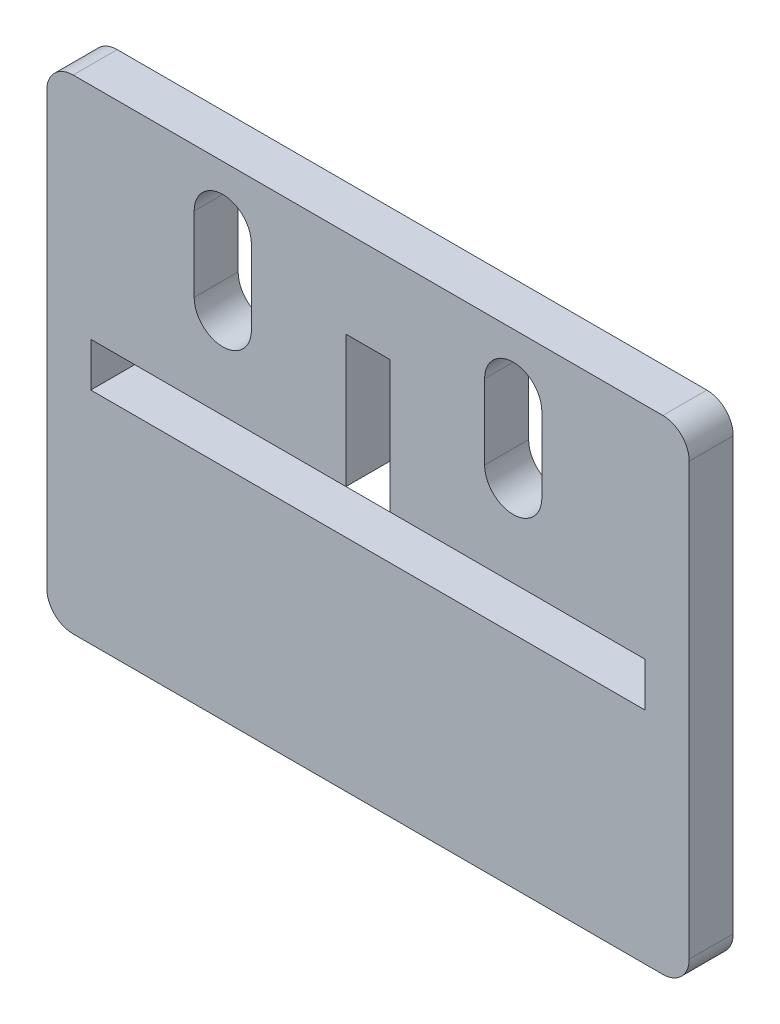
ISO-10303-21;
HEADER;
FILE_DESCRIPTION(('STEP AP214'),'2;1');
FILE_NAME('part.step','',(''),(''),'','','');
FILE_SCHEMA(('AUTOMOTIVE_DESIGN { 1 0 10303 214 1 1 1 1 }'));
ENDSEC;
DATA;
#1=APPLICATION_CONTEXT('core data for automotive mechanical design processes');
#2=APPLICATION_PROTOCOL_DEFINITION('international standard','automotive_design',2000,#1);
#3=PRODUCT_CONTEXT('',#1,'mechanical');
#4=PRODUCT('Part','Part','',(#3));
#5=PRODUCT_RELATED_PRODUCT_CATEGORY('part','',(#4));
#6=PRODUCT_DEFINITION_FORMATION('','',#4);
#7=PRODUCT_DEFINITION_CONTEXT('part definition',#1,'design');
#8=PRODUCT_DEFINITION('design','',#6,#7);
#9=PRODUCT_DEFINITION_SHAPE('','',#8);
#10=(LENGTH_UNIT() NAMED_UNIT(*) SI_UNIT(.MILLI.,.METRE.));
#11=(NAMED_UNIT(*) PLANE_ANGLE_UNIT() SI_UNIT($,.RADIAN.));
#12=(NAMED_UNIT(*) SI_UNIT($,.STERADIAN.) SOLID_ANGLE_UNIT());
#13=UNCERTAINTY_MEASURE_WITH_UNIT(LENGTH_MEASURE(1.E-05),#10,'distance_accuracy_value','');
#14=(GEOMETRIC_REPRESENTATION_CONTEXT(3) GLOBAL_UNCERTAINTY_ASSIGNED_CONTEXT((#13)) GLOBAL_UNIT_ASSIGNED_CONTEXT((#10,
#11,#12)) REPRESENTATION_CONTEXT('',''));
#15=CARTESIAN_POINT('',(0.,0.,0.));
#16=DIRECTION('',(0.,0.,1.));
#17=DIRECTION('',(1.,0.,0.));
#18=AXIS2_PLACEMENT_3D('',#15,#16,#17);
#19=CARTESIAN_POINT('',(33.5,24.5,5.));
#20=DIRECTION('',(0.,0.,1.));
#21=DIRECTION('',(1.,0.,0.));
#22=AXIS2_PLACEMENT_3D('',#19,#20,#21);
#23=PLANE('',#22);
#24=CARTESIAN_POINT('',(33.5,24.5,5.));
#25=DIRECTION('',(0.,0.,1.));
#26=DIRECTION('',(1.,0.,0.));
#27=AXIS2_PLACEMENT_3D('',#24,#25,#26);
#28=CIRCLE('',#27,3.);
#29=CARTESIAN_POINT('',(36.5,24.5,5.));
#30=VERTEX_POINT('',#29);
#31=CARTESIAN_POINT('',(33.5,27.5,5.));
#32=VERTEX_POINT('',#31);
#33=EDGE_CURVE('E322',#30,#32,#28,.T.);
#34=ORIENTED_EDGE('',*,*,#33,.T.);
#35=DIRECTION('',(-1.,0.,0.));
#36=VECTOR('',#35,1.);
#37=CARTESIAN_POINT('',(33.5,27.5,5.));
#38=LINE('',#37,#36);
#39=CARTESIAN_POINT('',(-33.5,27.5,5.));
#40=VERTEX_POINT('',#39);
#41=EDGE_CURVE('E325',#32,#40,#38,.T.);
#42=ORIENTED_EDGE('',*,*,#41,.T.);
#43=CARTESIAN_POINT('',(-33.5,24.5,5.));
#44=DIRECTION('',(0.,0.,1.));
#45=DIRECTION('',(1.,0.,0.));
#46=AXIS2_PLACEMENT_3D('',#43,#44,#45);
#47=CIRCLE('',#46,3.);
#48=CARTESIAN_POINT('',(-36.5,24.5,5.));
#49=VERTEX_POINT('',#48);
#50=EDGE_CURVE('E328',#40,#49,#47,.T.);
#51=ORIENTED_EDGE('',*,*,#50,.T.);
#52=DIRECTION('',(0.,-1.,0.));
#53=VECTOR('',#52,1.);
#54=CARTESIAN_POINT('',(-36.5,-24.5,5.));
#55=LINE('',#54,#53);
#56=CARTESIAN_POINT('',(-36.5,-24.5,5.));
#57=VERTEX_POINT('',#56);
#58=EDGE_CURVE('E330',#49,#57,#55,.T.);
#59=ORIENTED_EDGE('',*,*,#58,.T.);
#60=CARTESIAN_POINT('',(-33.5,-24.5,5.));
#61=DIRECTION('',(0.,0.,1.));
#62=DIRECTION('',(-1.,0.,0.));
#63=AXIS2_PLACEMENT_3D('',#60,#61,#62);
#64=CIRCLE('',#63,3.);
#65=CARTESIAN_POINT('',(-33.5,-27.5,5.));
#66=VERTEX_POINT('',#65);
#67=EDGE_CURVE('E332',#57,#66,#64,.T.);
#68=ORIENTED_EDGE('',*,*,#67,.T.);
#69=DIRECTION('',(1.,0.,0.));
#70=VECTOR('',#69,1.);
#71=CARTESIAN_POINT('',(33.5,-27.5,5.));
#72=LINE('',#71,#70);
#73=CARTESIAN_POINT('',(33.5,-27.5,5.));
#74=VERTEX_POINT('',#73);
#75=EDGE_CURVE('E334',#66,#74,#72,.T.);
#76=ORIENTED_EDGE('',*,*,#75,.T.);
#77=CARTESIAN_POINT('',(33.5,-24.5,5.));
#78=DIRECTION('',(0.,0.,1.));
#79=DIRECTION('',(1.,0.,0.));
#80=AXIS2_PLACEMENT_3D('',#77,#78,#79);
#81=CIRCLE('',#80,3.);
#82=CARTESIAN_POINT('',(36.5,-24.5,5.));
#83=VERTEX_POINT('',#82);
#84=EDGE_CURVE('E336',#74,#83,#81,.T.);
#85=ORIENTED_EDGE('',*,*,#84,.T.);
#86=DIRECTION('',(0.,1.,0.));
#87=VECTOR('',#86,1.);
#88=CARTESIAN_POINT('',(36.5,-24.5,5.));
#89=LINE('',#88,#87);
#90=EDGE_CURVE('E338',#83,#30,#89,.T.);
#91=ORIENTED_EDGE('',*,*,#90,.T.);
#92=EDGE_LOOP('',(#34,#42,#51,#59,#68,#76,#85,#91));
#93=FACE_BOUND('',#92,.T.);
#94=DIRECTION('',(-1.,0.,0.));
#95=VECTOR('',#94,1.);
#96=CARTESIAN_POINT('',(2.5,2.5,5.));
#97=LINE('',#96,#95);
#98=CARTESIAN_POINT('',(31.5,2.5,5.));
#99=VERTEX_POINT('',#98);
#100=CARTESIAN_POINT('',(2.5,2.5,5.));
#101=VERTEX_POINT('',#100);
#102=EDGE_CURVE('E265',#99,#101,#97,.T.);
#103=ORIENTED_EDGE('',*,*,#102,.F.);
#104=DIRECTION('',(0.,1.,0.));
#105=VECTOR('',#104,1.);
#106=CARTESIAN_POINT('',(31.5,-2.5,5.));
#107=LINE('',#106,#105);
#108=CARTESIAN_POINT('',(31.5,-2.5,5.));
#109=VERTEX_POINT('',#108);
#110=EDGE_CURVE('E263',#109,#99,#107,.T.);
#111=ORIENTED_EDGE('',*,*,#110,.F.);
#112=DIRECTION('',(1.,0.,0.));
#113=VECTOR('',#112,1.);
#114=CARTESIAN_POINT('',(-31.5,-2.5,5.));
#115=LINE('',#114,#113);
#116=CARTESIAN_POINT('',(-31.5,-2.5,5.));
#117=VERTEX_POINT('',#116);
#118=EDGE_CURVE('E279',#117,#109,#115,.T.);
#119=ORIENTED_EDGE('',*,*,#118,.F.);
#120=DIRECTION('',(0.,-1.,0.));
#121=VECTOR('',#120,1.);
#122=CARTESIAN_POINT('',(-31.5,2.49999999999999,5.));
#123=LINE('',#122,#121);
#124=CARTESIAN_POINT('',(-31.5,2.49999999999999,5.));
#125=VERTEX_POINT('',#124);
#126=EDGE_CURVE('E276',#125,#117,#123,.T.);
#127=ORIENTED_EDGE('',*,*,#126,.F.);
#128=DIRECTION('',(-1.,0.,0.));
#129=VECTOR('',#128,1.);
#130=CARTESIAN_POINT('',(-31.5,2.49999999999999,5.));
#131=LINE('',#130,#129);
#132=CARTESIAN_POINT('',(-2.5,2.5,5.));
#133=VERTEX_POINT('',#132);
#134=EDGE_CURVE('E274',#133,#125,#131,.T.);
#135=ORIENTED_EDGE('',*,*,#134,.F.);
#136=DIRECTION('',(0.,-1.,0.));
#137=VECTOR('',#136,1.);
#138=CARTESIAN_POINT('',(-2.5,17.5,5.));
#139=LINE('',#138,#137);
#140=CARTESIAN_POINT('',(-2.5,17.5,5.));
#141=VERTEX_POINT('',#140);
#142=EDGE_CURVE('E272',#141,#133,#139,.T.);
#143=ORIENTED_EDGE('',*,*,#142,.F.);
#144=DIRECTION('',(-1.,0.,0.));
#145=VECTOR('',#144,1.);
#146=CARTESIAN_POINT('',(2.5,17.5,5.));
#147=LINE('',#146,#145);
#148=CARTESIAN_POINT('',(2.5,17.5,5.));
#149=VERTEX_POINT('',#148);
#150=EDGE_CURVE('E270',#149,#141,#147,.T.);
#151=ORIENTED_EDGE('',*,*,#150,.F.);
#152=DIRECTION('',(0.,1.,0.));
#153=VECTOR('',#152,1.);
#154=CARTESIAN_POINT('',(2.5,17.5,5.));
#155=LINE('',#154,#153);
#156=EDGE_CURVE('E268',#101,#149,#155,.T.);
#157=ORIENTED_EDGE('',*,*,#156,.F.);
#158=EDGE_LOOP('',(#103,#111,#119,#127,#135,#143,#151,#157));
#159=FACE_BOUND('',#158,.T.);
#160=DIRECTION('',(0.,-1.,0.));
#161=VECTOR('',#160,1.);
#162=CARTESIAN_POINT('',(13.25,21.0000000000003,5.));
#163=LINE('',#162,#161);
#164=CARTESIAN_POINT('',(13.25,21.0000000000003,5.));
#165=VERTEX_POINT('',#164);
#166=CARTESIAN_POINT('',(13.25,12.5000000000003,5.));
#167=VERTEX_POINT('',#166);
#168=EDGE_CURVE('E234',#165,#167,#163,.T.);
#169=ORIENTED_EDGE('',*,*,#168,.F.);
#170=CARTESIAN_POINT('',(16.5,21.0000000000003,5.));
#171=DIRECTION('',(0.,0.,1.));
#172=DIRECTION('',(1.,0.,0.));
#173=AXIS2_PLACEMENT_3D('',#170,#171,#172);
#174=CIRCLE('',#173,3.25);
#175=CARTESIAN_POINT('',(19.75,21.0000000000003,5.));
#176=VERTEX_POINT('',#175);
#177=EDGE_CURVE('E232',#176,#165,#174,.T.);
#178=ORIENTED_EDGE('',*,*,#177,.F.);
#179=DIRECTION('',(0.,1.,0.));
#180=VECTOR('',#179,1.);
#181=CARTESIAN_POINT('',(19.75,12.5000000000003,5.));
#182=LINE('',#181,#180);
#183=CARTESIAN_POINT('',(19.75,12.5000000000003,5.));
#184=VERTEX_POINT('',#183);
#185=EDGE_CURVE('E240',#184,#176,#182,.T.);
#186=ORIENTED_EDGE('',*,*,#185,.F.);
#187=CARTESIAN_POINT('',(16.5,12.5000000000003,5.));
#188=DIRECTION('',(0.,0.,1.));
#189=DIRECTION('',(1.,0.,0.));
#190=AXIS2_PLACEMENT_3D('',#187,#188,#189);
#191=CIRCLE('',#190,3.25);
#192=EDGE_CURVE('E237',#167,#184,#191,.T.);
#193=ORIENTED_EDGE('',*,*,#192,.F.);
#194=EDGE_LOOP('',(#169,#178,#186,#193));
#195=FACE_BOUND('',#194,.T.);
#196=DIRECTION('',(0.,-1.,0.));
#197=VECTOR('',#196,1.);
#198=CARTESIAN_POINT('',(-19.75,12.5000000000003,5.));
#199=LINE('',#198,#197);
#200=CARTESIAN_POINT('',(-19.75,21.0000000000003,5.));
#201=VERTEX_POINT('',#200);
#202=CARTESIAN_POINT('',(-19.75,12.5000000000003,5.));
#203=VERTEX_POINT('',#202);
#204=EDGE_CURVE('E204',#201,#203,#199,.T.);
#205=ORIENTED_EDGE('',*,*,#204,.F.);
#206=CARTESIAN_POINT('',(-16.5,21.0000000000003,5.));
#207=DIRECTION('',(0.,0.,1.));
#208=DIRECTION('',(-1.,0.,0.));
#209=AXIS2_PLACEMENT_3D('',#206,#207,#208);
#210=CIRCLE('',#209,3.25);
#211=CARTESIAN_POINT('',(-13.25,21.0000000000003,5.));
#212=VERTEX_POINT('',#211);
#213=EDGE_CURVE('E196',#212,#201,#210,.T.);
#214=ORIENTED_EDGE('',*,*,#213,.F.);
#215=DIRECTION('',(0.,1.,0.));
#216=VECTOR('',#215,1.);
#217=CARTESIAN_POINT('',(-13.25,21.0000000000003,5.));
#218=LINE('',#217,#216);
#219=CARTESIAN_POINT('',(-13.25,12.5000000000003,5.));
#220=VERTEX_POINT('',#219);
#221=EDGE_CURVE('E218',#220,#212,#218,.T.);
#222=ORIENTED_EDGE('',*,*,#221,.F.);
#223=CARTESIAN_POINT('',(-16.5,12.5000000000003,5.));
#224=DIRECTION('',(0.,0.,1.));
#225=DIRECTION('',(-1.,0.,0.));
#226=AXIS2_PLACEMENT_3D('',#223,#224,#225);
#227=CIRCLE('',#226,3.25);
#228=EDGE_CURVE('E216',#203,#220,#227,.T.);
#229=ORIENTED_EDGE('',*,*,#228,.F.);
#230=EDGE_LOOP('',(#205,#214,#222,#229));
#231=FACE_BOUND('',#230,.T.);
#232=ADVANCED_FACE('F35',(#93,#159,#195,#231),#23,.T.);
#233=CARTESIAN_POINT('',(33.5,24.5,0.));
#234=DIRECTION('',(0.,0.,1.));
#235=DIRECTION('',(1.,0.,0.));
#236=AXIS2_PLACEMENT_3D('',#233,#234,#235);
#237=PLANE('',#236);
#238=CARTESIAN_POINT('',(16.5,21.0000000000003,0.));
#239=DIRECTION('',(0.,0.,1.));
#240=DIRECTION('',(1.,0.,0.));
#241=AXIS2_PLACEMENT_3D('',#238,#239,#240);
#242=CIRCLE('',#241,3.25);
#243=CARTESIAN_POINT('',(19.75,21.0000000000003,0.));
#244=VERTEX_POINT('',#243);
#245=CARTESIAN_POINT('',(13.25,21.0000000000003,0.));
#246=VERTEX_POINT('',#245);
#247=EDGE_CURVE('E212',#244,#246,#242,.T.);
#248=ORIENTED_EDGE('',*,*,#247,.T.);
#249=DIRECTION('',(0.,-1.,0.));
#250=VECTOR('',#249,1.);
#251=CARTESIAN_POINT('',(13.25,21.0000000000003,0.));
#252=LINE('',#251,#250);
#253=CARTESIAN_POINT('',(13.25,12.5000000000003,0.));
#254=VERTEX_POINT('',#253);
#255=EDGE_CURVE('E245',#246,#254,#252,.T.);
#256=ORIENTED_EDGE('',*,*,#255,.T.);
#257=CARTESIAN_POINT('',(16.5,12.5000000000003,0.));
#258=DIRECTION('',(0.,0.,1.));
#259=DIRECTION('',(1.,0.,0.));
#260=AXIS2_PLACEMENT_3D('',#257,#258,#259);
#261=CIRCLE('',#260,3.25);
#262=CARTESIAN_POINT('',(19.75,12.5000000000003,0.));
#263=VERTEX_POINT('',#262);
#264=EDGE_CURVE('E248',#254,#263,#261,.T.);
#265=ORIENTED_EDGE('',*,*,#264,.T.);
#266=DIRECTION('',(0.,1.,0.));
#267=VECTOR('',#266,1.);
#268=CARTESIAN_POINT('',(19.75,12.5000000000003,0.));
#269=LINE('',#268,#267);
#270=EDGE_CURVE('E235',#263,#244,#269,.T.);
#271=ORIENTED_EDGE('',*,*,#270,.T.);
#272=EDGE_LOOP('',(#248,#256,#265,#271));
#273=FACE_BOUND('',#272,.T.);
#274=CARTESIAN_POINT('',(33.5,24.5,0.));
#275=DIRECTION('',(0.,0.,1.));
#276=DIRECTION('',(1.,0.,0.));
#277=AXIS2_PLACEMENT_3D('',#274,#275,#276);
#278=CIRCLE('',#277,3.);
#279=CARTESIAN_POINT('',(36.5,24.5,0.));
#280=VERTEX_POINT('',#279);
#281=CARTESIAN_POINT('',(33.5,27.5,0.));
#282=VERTEX_POINT('',#281);
#283=EDGE_CURVE('E321',#280,#282,#278,.T.);
#284=ORIENTED_EDGE('',*,*,#283,.F.);
#285=DIRECTION('',(0.,1.,0.));
#286=VECTOR('',#285,1.);
#287=CARTESIAN_POINT('',(36.5,-24.5,0.));
#288=LINE('',#287,#286);
#289=CARTESIAN_POINT('',(36.5,-24.5,0.));
#290=VERTEX_POINT('',#289);
#291=EDGE_CURVE('E326',#290,#280,#288,.T.);
#292=ORIENTED_EDGE('',*,*,#291,.F.);
#293=CARTESIAN_POINT('',(33.5,-24.5,0.));
#294=DIRECTION('',(0.,0.,1.));
#295=DIRECTION('',(1.,0.,0.));
#296=AXIS2_PLACEMENT_3D('',#293,#294,#295);
#297=CIRCLE('',#296,3.);
#298=CARTESIAN_POINT('',(33.5,-27.5,0.));
#299=VERTEX_POINT('',#298);
#300=EDGE_CURVE('E353',#299,#290,#297,.T.);
#301=ORIENTED_EDGE('',*,*,#300,.F.);
#302=DIRECTION('',(1.,0.,0.));
#303=VECTOR('',#302,1.);
#304=CARTESIAN_POINT('',(33.5,-27.5,0.));
#305=LINE('',#304,#303);
#306=CARTESIAN_POINT('',(-33.5,-27.5,0.));
#307=VERTEX_POINT('',#306);
#308=EDGE_CURVE('E351',#307,#299,#305,.T.);
#309=ORIENTED_EDGE('',*,*,#308,.F.);
#310=CARTESIAN_POINT('',(-33.5,-24.5,0.));
#311=DIRECTION('',(0.,0.,1.));
#312=DIRECTION('',(-1.,0.,0.));
#313=AXIS2_PLACEMENT_3D('',#310,#311,#312);
#314=CIRCLE('',#313,3.);
#315=CARTESIAN_POINT('',(-36.5,-24.5,0.));
#316=VERTEX_POINT('',#315);
#317=EDGE_CURVE('E349',#316,#307,#314,.T.);
#318=ORIENTED_EDGE('',*,*,#317,.F.);
#319=DIRECTION('',(0.,-1.,0.));
#320=VECTOR('',#319,1.);
#321=CARTESIAN_POINT('',(-36.5,-24.5,0.));
#322=LINE('',#321,#320);
#323=CARTESIAN_POINT('',(-36.5,24.5,0.));
#324=VERTEX_POINT('',#323);
#325=EDGE_CURVE('E347',#324,#316,#322,.T.);
#326=ORIENTED_EDGE('',*,*,#325,.F.);
#327=CARTESIAN_POINT('',(-33.5,24.5,0.));
#328=DIRECTION('',(0.,0.,1.));
#329=DIRECTION('',(1.,0.,0.));
#330=AXIS2_PLACEMENT_3D('',#327,#328,#329);
#331=CIRCLE('',#330,3.);
#332=CARTESIAN_POINT('',(-33.5,27.5,0.));
#333=VERTEX_POINT('',#332);
#334=EDGE_CURVE('E345',#333,#324,#331,.T.);
#335=ORIENTED_EDGE('',*,*,#334,.F.);
#336=DIRECTION('',(-1.,0.,0.));
#337=VECTOR('',#336,1.);
#338=CARTESIAN_POINT('',(33.5,27.5,0.));
#339=LINE('',#338,#337);
#340=EDGE_CURVE('E343',#282,#333,#339,.T.);
#341=ORIENTED_EDGE('',*,*,#340,.F.);
#342=EDGE_LOOP('',(#284,#292,#301,#309,#318,#326,#335,#341));
#343=FACE_BOUND('',#342,.T.);
#344=DIRECTION('',(0.,1.,0.));
#345=VECTOR('',#344,1.);
#346=CARTESIAN_POINT('',(31.5,-2.5,0.));
#347=LINE('',#346,#345);
#348=CARTESIAN_POINT('',(31.5,-2.5,0.));
#349=VERTEX_POINT('',#348);
#350=CARTESIAN_POINT('',(31.5,2.5,0.));
#351=VERTEX_POINT('',#350);
#352=EDGE_CURVE('E262',#349,#351,#347,.T.);
#353=ORIENTED_EDGE('',*,*,#352,.T.);
#354=DIRECTION('',(-1.,0.,0.));
#355=VECTOR('',#354,1.);
#356=CARTESIAN_POINT('',(2.5,2.5,0.));
#357=LINE('',#356,#355);
#358=CARTESIAN_POINT('',(2.5,2.5,0.));
#359=VERTEX_POINT('',#358);
#360=EDGE_CURVE('E284',#351,#359,#357,.T.);
#361=ORIENTED_EDGE('',*,*,#360,.T.);
#362=DIRECTION('',(0.,1.,0.));
#363=VECTOR('',#362,1.);
#364=CARTESIAN_POINT('',(2.5,17.5,0.));
#365=LINE('',#364,#363);
#366=CARTESIAN_POINT('',(2.5,17.5,0.));
#367=VERTEX_POINT('',#366);
#368=EDGE_CURVE('E287',#359,#367,#365,.T.);
#369=ORIENTED_EDGE('',*,*,#368,.T.);
#370=DIRECTION('',(-1.,0.,0.));
#371=VECTOR('',#370,1.);
#372=CARTESIAN_POINT('',(2.5,17.5,0.));
#373=LINE('',#372,#371);
#374=CARTESIAN_POINT('',(-2.5,17.5,0.));
#375=VERTEX_POINT('',#374);
#376=EDGE_CURVE('E290',#367,#375,#373,.T.);
#377=ORIENTED_EDGE('',*,*,#376,.T.);
#378=DIRECTION('',(0.,-1.,0.));
#379=VECTOR('',#378,1.);
#380=CARTESIAN_POINT('',(-2.5,17.5,0.));
#381=LINE('',#380,#379);
#382=CARTESIAN_POINT('',(-2.5,2.5,0.));
#383=VERTEX_POINT('',#382);
#384=EDGE_CURVE('E293',#375,#383,#381,.T.);
#385=ORIENTED_EDGE('',*,*,#384,.T.);
#386=DIRECTION('',(-1.,0.,0.));
#387=VECTOR('',#386,1.);
#388=CARTESIAN_POINT('',(-31.5,2.49999999999999,0.));
#389=LINE('',#388,#387);
#390=CARTESIAN_POINT('',(-31.5,2.49999999999999,0.));
#391=VERTEX_POINT('',#390);
#392=EDGE_CURVE('E296',#383,#391,#389,.T.);
#393=ORIENTED_EDGE('',*,*,#392,.T.);
#394=DIRECTION('',(0.,-1.,0.));
#395=VECTOR('',#394,1.);
#396=CARTESIAN_POINT('',(-31.5,2.49999999999999,0.));
#397=LINE('',#396,#395);
#398=CARTESIAN_POINT('',(-31.5,-2.5,0.));
#399=VERTEX_POINT('',#398);
#400=EDGE_CURVE('E299',#391,#399,#397,.T.);
#401=ORIENTED_EDGE('',*,*,#400,.T.);
#402=DIRECTION('',(1.,0.,0.));
#403=VECTOR('',#402,1.);
#404=CARTESIAN_POINT('',(-31.5,-2.5,0.));
#405=LINE('',#404,#403);
#406=EDGE_CURVE('E266',#399,#349,#405,.T.);
#407=ORIENTED_EDGE('',*,*,#406,.T.);
#408=EDGE_LOOP('',(#353,#361,#369,#377,#385,#393,#401,#407));
#409=FACE_BOUND('',#408,.T.);
#410=CARTESIAN_POINT('',(-16.5,21.0000000000003,0.));
#411=DIRECTION('',(0.,0.,1.));
#412=DIRECTION('',(-1.,0.,0.));
#413=AXIS2_PLACEMENT_3D('',#410,#411,#412);
#414=CIRCLE('',#413,3.25);
#415=CARTESIAN_POINT('',(-13.25,21.0000000000003,0.));
#416=VERTEX_POINT('',#415);
#417=CARTESIAN_POINT('',(-19.75,21.0000000000003,0.));
#418=VERTEX_POINT('',#417);
#419=EDGE_CURVE('E58',#416,#418,#414,.T.);
#420=ORIENTED_EDGE('',*,*,#419,.T.);
#421=DIRECTION('',(0.,-1.,0.));
#422=VECTOR('',#421,1.);
#423=CARTESIAN_POINT('',(-19.75,12.5000000000003,0.));
#424=LINE('',#423,#422);
#425=CARTESIAN_POINT('',(-19.75,12.5000000000003,0.));
#426=VERTEX_POINT('',#425);
#427=EDGE_CURVE('E211',#418,#426,#424,.T.);
#428=ORIENTED_EDGE('',*,*,#427,.T.);
#429=CARTESIAN_POINT('',(-16.5,12.5000000000003,0.));
#430=DIRECTION('',(0.,0.,1.));
#431=DIRECTION('',(-1.,0.,0.));
#432=AXIS2_PLACEMENT_3D('',#429,#430,#431);
#433=CIRCLE('',#432,3.25);
#434=CARTESIAN_POINT('',(-13.25,12.5000000000003,0.));
#435=VERTEX_POINT('',#434);
#436=EDGE_CURVE('E224',#426,#435,#433,.T.);
#437=ORIENTED_EDGE('',*,*,#436,.T.);
#438=DIRECTION('',(0.,1.,0.));
#439=VECTOR('',#438,1.);
#440=CARTESIAN_POINT('',(-13.25,21.0000000000003,0.));
#441=LINE('',#440,#439);
#442=EDGE_CURVE('E205',#435,#416,#441,.T.);
#443=ORIENTED_EDGE('',*,*,#442,.T.);
#444=EDGE_LOOP('',(#420,#428,#437,#443));
#445=FACE_BOUND('',#444,.T.);
#446=ADVANCED_FACE('F383',(#273,#343,#409,#445),#237,.F.);
#447=CARTESIAN_POINT('',(33.5,24.5,5.));
#448=DIRECTION('',(0.,0.,-1.));
#449=DIRECTION('',(-1.,0.,0.));
#450=AXIS2_PLACEMENT_3D('',#447,#448,#449);
#451=CYLINDRICAL_SURFACE('',#450,3.);
#452=ORIENTED_EDGE('',*,*,#283,.T.);
#453=DIRECTION('',(0.,0.,-1.));
#454=VECTOR('',#453,1.);
#455=CARTESIAN_POINT('',(33.5,27.5,5.));
#456=LINE('',#455,#454);
#457=EDGE_CURVE('E11',#32,#282,#456,.T.);
#458=ORIENTED_EDGE('',*,*,#457,.F.);
#459=ORIENTED_EDGE('',*,*,#33,.F.);
#460=DIRECTION('',(0.,0.,-1.));
#461=VECTOR('',#460,1.);
#462=CARTESIAN_POINT('',(36.5,24.5,5.));
#463=LINE('',#462,#461);
#464=EDGE_CURVE('E340',#30,#280,#463,.T.);
#465=ORIENTED_EDGE('',*,*,#464,.T.);
#466=EDGE_LOOP('',(#452,#458,#459,#465));
#467=FACE_BOUND('',#466,.T.);
#468=ADVANCED_FACE('F37',(#467),#451,.T.);
#469=CARTESIAN_POINT('',(33.5,27.5,5.));
#470=DIRECTION('',(0.,-1.,0.));
#471=DIRECTION('',(0.,0.,-1.));
#472=AXIS2_PLACEMENT_3D('',#469,#470,#471);
#473=PLANE('',#472);
#474=ORIENTED_EDGE('',*,*,#340,.T.);
#475=DIRECTION('',(0.,0.,-1.));
#476=VECTOR('',#475,1.);
#477=CARTESIAN_POINT('',(-33.5,27.5,5.));
#478=LINE('',#477,#476);
#479=EDGE_CURVE('E43',#40,#333,#478,.T.);
#480=ORIENTED_EDGE('',*,*,#479,.F.);
#481=ORIENTED_EDGE('',*,*,#41,.F.);
#482=ORIENTED_EDGE('',*,*,#457,.T.);
#483=EDGE_LOOP('',(#474,#480,#481,#482));
#484=FACE_BOUND('',#483,.T.);
#485=ADVANCED_FACE('F401',(#484),#473,.F.);
#486=CARTESIAN_POINT('',(-33.5,24.5,5.));
#487=DIRECTION('',(0.,0.,-1.));
#488=DIRECTION('',(-1.,0.,0.));
#489=AXIS2_PLACEMENT_3D('',#486,#487,#488);
#490=CYLINDRICAL_SURFACE('',#489,3.);
#491=ORIENTED_EDGE('',*,*,#334,.T.);
#492=DIRECTION('',(0.,0.,-1.));
#493=VECTOR('',#492,1.);
#494=CARTESIAN_POINT('',(-36.5,24.5,5.));
#495=LINE('',#494,#493);
#496=EDGE_CURVE('E370',#49,#324,#495,.T.);
#497=ORIENTED_EDGE('',*,*,#496,.F.);
#498=ORIENTED_EDGE('',*,*,#50,.F.);
#499=ORIENTED_EDGE('',*,*,#479,.T.);
#500=EDGE_LOOP('',(#491,#497,#498,#499));
#501=FACE_BOUND('',#500,.T.);
#502=ADVANCED_FACE('F377',(#501),#490,.T.);
#503=CARTESIAN_POINT('',(-36.5,-24.5,5.));
#504=DIRECTION('',(1.,0.,0.));
#505=DIRECTION('',(0.,0.,-1.));
#506=AXIS2_PLACEMENT_3D('',#503,#504,#505);
#507=PLANE('',#506);
#508=ORIENTED_EDGE('',*,*,#325,.T.);
#509=DIRECTION('',(0.,0.,-1.));
#510=VECTOR('',#509,1.);
#511=CARTESIAN_POINT('',(-36.5,-24.5,5.));
#512=LINE('',#511,#510);
#513=EDGE_CURVE('E367',#57,#316,#512,.T.);
#514=ORIENTED_EDGE('',*,*,#513,.F.);
#515=ORIENTED_EDGE('',*,*,#58,.F.);
#516=ORIENTED_EDGE('',*,*,#496,.T.);
#517=EDGE_LOOP('',(#508,#514,#515,#516));
#518=FACE_BOUND('',#517,.T.);
#519=ADVANCED_FACE('F389',(#518),#507,.F.);
#520=CARTESIAN_POINT('',(-33.5,-24.5,5.));
#521=DIRECTION('',(0.,0.,-1.));
#522=DIRECTION('',(-1.,0.,0.));
#523=AXIS2_PLACEMENT_3D('',#520,#521,#522);
#524=CYLINDRICAL_SURFACE('',#523,3.);
#525=ORIENTED_EDGE('',*,*,#317,.T.);
#526=DIRECTION('',(0.,0.,-1.));
#527=VECTOR('',#526,1.);
#528=CARTESIAN_POINT('',(-33.5,-27.5,5.));
#529=LINE('',#528,#527);
#530=EDGE_CURVE('E364',#66,#307,#529,.T.);
#531=ORIENTED_EDGE('',*,*,#530,.F.);
#532=ORIENTED_EDGE('',*,*,#67,.F.);
#533=ORIENTED_EDGE('',*,*,#513,.T.);
#534=EDGE_LOOP('',(#525,#531,#532,#533));
#535=FACE_BOUND('',#534,.T.);
#536=ADVANCED_FACE('F393',(#535),#524,.T.);
#537=CARTESIAN_POINT('',(33.5,-27.5,5.));
#538=DIRECTION('',(0.,1.,0.));
#539=DIRECTION('',(0.,0.,1.));
#540=AXIS2_PLACEMENT_3D('',#537,#538,#539);
#541=PLANE('',#540);
#542=ORIENTED_EDGE('',*,*,#308,.T.);
#543=DIRECTION('',(0.,0.,-1.));
#544=VECTOR('',#543,1.);
#545=CARTESIAN_POINT('',(33.5,-27.5,5.));
#546=LINE('',#545,#544);
#547=EDGE_CURVE('E361',#74,#299,#546,.T.);
#548=ORIENTED_EDGE('',*,*,#547,.F.);
#549=ORIENTED_EDGE('',*,*,#75,.F.);
#550=ORIENTED_EDGE('',*,*,#530,.T.);
#551=EDGE_LOOP('',(#542,#548,#549,#550));
#552=FACE_BOUND('',#551,.T.);
#553=ADVANCED_FACE('F414',(#552),#541,.F.);
#554=CARTESIAN_POINT('',(33.5,-24.5,5.));
#555=DIRECTION('',(0.,0.,-1.));
#556=DIRECTION('',(-1.,0.,0.));
#557=AXIS2_PLACEMENT_3D('',#554,#555,#556);
#558=CYLINDRICAL_SURFACE('',#557,3.);
#559=ORIENTED_EDGE('',*,*,#300,.T.);
#560=DIRECTION('',(0.,0.,-1.));
#561=VECTOR('',#560,1.);
#562=CARTESIAN_POINT('',(36.5,-24.5,5.));
#563=LINE('',#562,#561);
#564=EDGE_CURVE('E358',#83,#290,#563,.T.);
#565=ORIENTED_EDGE('',*,*,#564,.F.);
#566=ORIENTED_EDGE('',*,*,#84,.F.);
#567=ORIENTED_EDGE('',*,*,#547,.T.);
#568=EDGE_LOOP('',(#559,#565,#566,#567));
#569=FACE_BOUND('',#568,.T.);
#570=ADVANCED_FACE('F412',(#569),#558,.T.);
#571=CARTESIAN_POINT('',(36.5,-24.5,5.));
#572=DIRECTION('',(-1.,0.,0.));
#573=DIRECTION('',(0.,0.,1.));
#574=AXIS2_PLACEMENT_3D('',#571,#572,#573);
#575=PLANE('',#574);
#576=ORIENTED_EDGE('',*,*,#291,.T.);
#577=ORIENTED_EDGE('',*,*,#464,.F.);
#578=ORIENTED_EDGE('',*,*,#90,.F.);
#579=ORIENTED_EDGE('',*,*,#564,.T.);
#580=EDGE_LOOP('',(#576,#577,#578,#579));
#581=FACE_BOUND('',#580,.T.);
#582=ADVANCED_FACE('F407',(#581),#575,.F.);
#583=CARTESIAN_POINT('',(31.5,-2.5,5.));
#584=DIRECTION('',(-1.,0.,0.));
#585=DIRECTION('',(0.,0.,1.));
#586=AXIS2_PLACEMENT_3D('',#583,#584,#585);
#587=PLANE('',#586);
#588=ORIENTED_EDGE('',*,*,#352,.F.);
#589=DIRECTION('',(0.,0.,-1.));
#590=VECTOR('',#589,1.);
#591=CARTESIAN_POINT('',(31.5,-2.5,5.));
#592=LINE('',#591,#590);
#593=EDGE_CURVE('E281',#109,#349,#592,.T.);
#594=ORIENTED_EDGE('',*,*,#593,.F.);
#595=ORIENTED_EDGE('',*,*,#110,.T.);
#596=DIRECTION('',(0.,0.,-1.));
#597=VECTOR('',#596,1.);
#598=CARTESIAN_POINT('',(31.5,2.5,5.));
#599=LINE('',#598,#597);
#600=EDGE_CURVE('E318',#99,#351,#599,.T.);
#601=ORIENTED_EDGE('',*,*,#600,.T.);
#602=EDGE_LOOP('',(#588,#594,#595,#601));
#603=FACE_BOUND('',#602,.T.);
#604=ADVANCED_FACE('F431',(#603),#587,.T.);
#605=CARTESIAN_POINT('',(2.5,2.5,5.));
#606=DIRECTION('',(0.,-1.,0.));
#607=DIRECTION('',(0.,0.,-1.));
#608=AXIS2_PLACEMENT_3D('',#605,#606,#607);
#609=PLANE('',#608);
#610=ORIENTED_EDGE('',*,*,#360,.F.);
#611=ORIENTED_EDGE('',*,*,#600,.F.);
#612=ORIENTED_EDGE('',*,*,#102,.T.);
#613=DIRECTION('',(0.,0.,-1.));
#614=VECTOR('',#613,1.);
#615=CARTESIAN_POINT('',(2.5,2.5,5.));
#616=LINE('',#615,#614);
#617=EDGE_CURVE('E316',#101,#359,#616,.T.);
#618=ORIENTED_EDGE('',*,*,#617,.T.);
#619=EDGE_LOOP('',(#610,#611,#612,#618));
#620=FACE_BOUND('',#619,.T.);
#621=ADVANCED_FACE('F438',(#620),#609,.T.);
#622=CARTESIAN_POINT('',(2.5,17.5,5.));
#623=DIRECTION('',(-1.,0.,0.));
#624=DIRECTION('',(0.,-1.,0.));
#625=AXIS2_PLACEMENT_3D('',#622,#623,#624);
#626=PLANE('',#625);
#627=ORIENTED_EDGE('',*,*,#368,.F.);
#628=ORIENTED_EDGE('',*,*,#617,.F.);
#629=ORIENTED_EDGE('',*,*,#156,.T.);
#630=DIRECTION('',(0.,0.,-1.));
#631=VECTOR('',#630,1.);
#632=CARTESIAN_POINT('',(2.5,17.5,5.));
#633=LINE('',#632,#631);
#634=EDGE_CURVE('E314',#149,#367,#633,.T.);
#635=ORIENTED_EDGE('',*,*,#634,.T.);
#636=EDGE_LOOP('',(#627,#628,#629,#635));
#637=FACE_BOUND('',#636,.T.);
#638=ADVANCED_FACE('F443',(#637),#626,.T.);
#639=CARTESIAN_POINT('',(2.5,17.5,5.));
#640=DIRECTION('',(0.,-1.,0.));
#641=DIRECTION('',(0.,0.,-1.));
#642=AXIS2_PLACEMENT_3D('',#639,#640,#641);
#643=PLANE('',#642);
#644=ORIENTED_EDGE('',*,*,#376,.F.);
#645=ORIENTED_EDGE('',*,*,#634,.F.);
#646=ORIENTED_EDGE('',*,*,#150,.T.);
#647=DIRECTION('',(0.,0.,-1.));
#648=VECTOR('',#647,1.);
#649=CARTESIAN_POINT('',(-2.5,17.5,5.));
#650=LINE('',#649,#648);
#651=EDGE_CURVE('E312',#141,#375,#650,.T.);
#652=ORIENTED_EDGE('',*,*,#651,.T.);
#653=EDGE_LOOP('',(#644,#645,#646,#652));
#654=FACE_BOUND('',#653,.T.);
#655=ADVANCED_FACE('F470',(#654),#643,.T.);
#656=CARTESIAN_POINT('',(-2.5,17.5,5.));
#657=DIRECTION('',(1.,0.,0.));
#658=DIRECTION('',(0.,1.,0.));
#659=AXIS2_PLACEMENT_3D('',#656,#657,#658);
#660=PLANE('',#659);
#661=ORIENTED_EDGE('',*,*,#384,.F.);
#662=ORIENTED_EDGE('',*,*,#651,.F.);
#663=ORIENTED_EDGE('',*,*,#142,.T.);
#664=DIRECTION('',(0.,0.,-1.));
#665=VECTOR('',#664,1.);
#666=CARTESIAN_POINT('',(-2.5,2.5,5.));
#667=LINE('',#666,#665);
#668=EDGE_CURVE('E310',#133,#383,#667,.T.);
#669=ORIENTED_EDGE('',*,*,#668,.T.);
#670=EDGE_LOOP('',(#661,#662,#663,#669));
#671=FACE_BOUND('',#670,.T.);
#672=ADVANCED_FACE('F475',(#671),#660,.T.);
#673=CARTESIAN_POINT('',(-31.5,2.49999999999999,5.));
#674=DIRECTION('',(0.,-1.,0.));
#675=DIRECTION('',(1.,0.,0.));
#676=AXIS2_PLACEMENT_3D('',#673,#674,#675);
#677=PLANE('',#676);
#678=ORIENTED_EDGE('',*,*,#392,.F.);
#679=ORIENTED_EDGE('',*,*,#668,.F.);
#680=ORIENTED_EDGE('',*,*,#134,.T.);
#681=DIRECTION('',(0.,0.,-1.));
#682=VECTOR('',#681,1.);
#683=CARTESIAN_POINT('',(-31.5,2.49999999999999,5.));
#684=LINE('',#683,#682);
#685=EDGE_CURVE('E308',#125,#391,#684,.T.);
#686=ORIENTED_EDGE('',*,*,#685,.T.);
#687=EDGE_LOOP('',(#678,#679,#680,#686));
#688=FACE_BOUND('',#687,.T.);
#689=ADVANCED_FACE('F478',(#688),#677,.T.);
#690=CARTESIAN_POINT('',(-31.5,2.49999999999999,5.));
#691=DIRECTION('',(1.,0.,0.));
#692=DIRECTION('',(0.,1.,0.));
#693=AXIS2_PLACEMENT_3D('',#690,#691,#692);
#694=PLANE('',#693);
#695=ORIENTED_EDGE('',*,*,#400,.F.);
#696=ORIENTED_EDGE('',*,*,#685,.F.);
#697=ORIENTED_EDGE('',*,*,#126,.T.);
#698=DIRECTION('',(0.,0.,-1.));
#699=VECTOR('',#698,1.);
#700=CARTESIAN_POINT('',(-31.5,-2.5,5.));
#701=LINE('',#700,#699);
#702=EDGE_CURVE('E306',#117,#399,#701,.T.);
#703=ORIENTED_EDGE('',*,*,#702,.T.);
#704=EDGE_LOOP('',(#695,#696,#697,#703));
#705=FACE_BOUND('',#704,.T.);
#706=ADVANCED_FACE('F457',(#705),#694,.T.);
#707=CARTESIAN_POINT('',(-31.5,-2.5,5.));
#708=DIRECTION('',(0.,1.,0.));
#709=DIRECTION('',(-1.,0.,0.));
#710=AXIS2_PLACEMENT_3D('',#707,#708,#709);
#711=PLANE('',#710);
#712=ORIENTED_EDGE('',*,*,#406,.F.);
#713=ORIENTED_EDGE('',*,*,#702,.F.);
#714=ORIENTED_EDGE('',*,*,#118,.T.);
#715=ORIENTED_EDGE('',*,*,#593,.T.);
#716=EDGE_LOOP('',(#712,#713,#714,#715));
#717=FACE_BOUND('',#716,.T.);
#718=ADVANCED_FACE('F450',(#717),#711,.T.);
#719=CARTESIAN_POINT('',(16.5,21.0000000000003,5.));
#720=DIRECTION('',(0.,0.,-1.));
#721=DIRECTION('',(-1.,0.,0.));
#722=AXIS2_PLACEMENT_3D('',#719,#720,#721);
#723=CYLINDRICAL_SURFACE('',#722,3.25);
#724=ORIENTED_EDGE('',*,*,#247,.F.);
#725=DIRECTION('',(0.,0.,-1.));
#726=VECTOR('',#725,1.);
#727=CARTESIAN_POINT('',(19.75,21.0000000000003,5.));
#728=LINE('',#727,#726);
#729=EDGE_CURVE('E242',#176,#244,#728,.T.);
#730=ORIENTED_EDGE('',*,*,#729,.F.);
#731=ORIENTED_EDGE('',*,*,#177,.T.);
#732=DIRECTION('',(0.,0.,-1.));
#733=VECTOR('',#732,1.);
#734=CARTESIAN_POINT('',(13.25,21.0000000000003,5.));
#735=LINE('',#734,#733);
#736=EDGE_CURVE('E259',#165,#246,#735,.T.);
#737=ORIENTED_EDGE('',*,*,#736,.T.);
#738=EDGE_LOOP('',(#724,#730,#731,#737));
#739=FACE_BOUND('',#738,.T.);
#740=ADVANCED_FACE('F523',(#739),#723,.F.);
#741=CARTESIAN_POINT('',(13.25,21.0000000000003,5.));
#742=DIRECTION('',(1.,0.,0.));
#743=DIRECTION('',(0.,0.,-1.));
#744=AXIS2_PLACEMENT_3D('',#741,#742,#743);
#745=PLANE('',#744);
#746=ORIENTED_EDGE('',*,*,#255,.F.);
#747=ORIENTED_EDGE('',*,*,#736,.F.);
#748=ORIENTED_EDGE('',*,*,#168,.T.);
#749=DIRECTION('',(0.,0.,-1.));
#750=VECTOR('',#749,1.);
#751=CARTESIAN_POINT('',(13.25,12.5000000000003,5.));
#752=LINE('',#751,#750);
#753=EDGE_CURVE('E257',#167,#254,#752,.T.);
#754=ORIENTED_EDGE('',*,*,#753,.T.);
#755=EDGE_LOOP('',(#746,#747,#748,#754));
#756=FACE_BOUND('',#755,.T.);
#757=ADVANCED_FACE('F531',(#756),#745,.T.);
#758=CARTESIAN_POINT('',(16.5,12.5000000000003,5.));
#759=DIRECTION('',(0.,0.,-1.));
#760=DIRECTION('',(-1.,0.,0.));
#761=AXIS2_PLACEMENT_3D('',#758,#759,#760);
#762=CYLINDRICAL_SURFACE('',#761,3.25);
#763=ORIENTED_EDGE('',*,*,#264,.F.);
#764=ORIENTED_EDGE('',*,*,#753,.F.);
#765=ORIENTED_EDGE('',*,*,#192,.T.);
#766=DIRECTION('',(0.,0.,-1.));
#767=VECTOR('',#766,1.);
#768=CARTESIAN_POINT('',(19.75,12.5000000000003,5.));
#769=LINE('',#768,#767);
#770=EDGE_CURVE('E255',#184,#263,#769,.T.);
#771=ORIENTED_EDGE('',*,*,#770,.T.);
#772=EDGE_LOOP('',(#763,#764,#765,#771));
#773=FACE_BOUND('',#772,.T.);
#774=ADVANCED_FACE('F541',(#773),#762,.F.);
#775=CARTESIAN_POINT('',(19.75,12.5000000000003,5.));
#776=DIRECTION('',(-1.,0.,0.));
#777=DIRECTION('',(0.,0.,1.));
#778=AXIS2_PLACEMENT_3D('',#775,#776,#777);
#779=PLANE('',#778);
#780=ORIENTED_EDGE('',*,*,#270,.F.);
#781=ORIENTED_EDGE('',*,*,#770,.F.);
#782=ORIENTED_EDGE('',*,*,#185,.T.);
#783=ORIENTED_EDGE('',*,*,#729,.T.);
#784=EDGE_LOOP('',(#780,#781,#782,#783));
#785=FACE_BOUND('',#784,.T.);
#786=ADVANCED_FACE('F551',(#785),#779,.T.);
#787=CARTESIAN_POINT('',(-16.5,21.0000000000003,5.));
#788=DIRECTION('',(0.,0.,-1.));
#789=DIRECTION('',(-1.,0.,0.));
#790=AXIS2_PLACEMENT_3D('',#787,#788,#789);
#791=CYLINDRICAL_SURFACE('',#790,3.25);
#792=ORIENTED_EDGE('',*,*,#419,.F.);
#793=DIRECTION('',(0.,0.,-1.));
#794=VECTOR('',#793,1.);
#795=CARTESIAN_POINT('',(-13.25,21.0000000000003,5.));
#796=LINE('',#795,#794);
#797=EDGE_CURVE('E200',#212,#416,#796,.T.);
#798=ORIENTED_EDGE('',*,*,#797,.F.);
#799=ORIENTED_EDGE('',*,*,#213,.T.);
#800=DIRECTION('',(0.,0.,-1.));
#801=VECTOR('',#800,1.);
#802=CARTESIAN_POINT('',(-19.75,21.0000000000003,5.));
#803=LINE('',#802,#801);
#804=EDGE_CURVE('E199',#201,#418,#803,.T.);
#805=ORIENTED_EDGE('',*,*,#804,.T.);
#806=EDGE_LOOP('',(#792,#798,#799,#805));
#807=FACE_BOUND('',#806,.T.);
#808=ADVANCED_FACE('F198',(#807),#791,.F.);
#809=CARTESIAN_POINT('',(-19.75,12.5000000000003,5.));
#810=DIRECTION('',(1.,0.,0.));
#811=DIRECTION('',(0.,1.,0.));
#812=AXIS2_PLACEMENT_3D('',#809,#810,#811);
#813=PLANE('',#812);
#814=ORIENTED_EDGE('',*,*,#427,.F.);
#815=ORIENTED_EDGE('',*,*,#804,.F.);
#816=ORIENTED_EDGE('',*,*,#204,.T.);
#817=DIRECTION('',(0.,0.,-1.));
#818=VECTOR('',#817,1.);
#819=CARTESIAN_POINT('',(-19.75,12.5000000000003,5.));
#820=LINE('',#819,#818);
#821=EDGE_CURVE('E213',#203,#426,#820,.T.);
#822=ORIENTED_EDGE('',*,*,#821,.T.);
#823=EDGE_LOOP('',(#814,#815,#816,#822));
#824=FACE_BOUND('',#823,.T.);
#825=ADVANCED_FACE('F208',(#824),#813,.T.);
#826=CARTESIAN_POINT('',(-16.5,12.5000000000003,5.));
#827=DIRECTION('',(0.,0.,-1.));
#828=DIRECTION('',(-1.,0.,0.));
#829=AXIS2_PLACEMENT_3D('',#826,#827,#828);
#830=CYLINDRICAL_SURFACE('',#829,3.25);
#831=ORIENTED_EDGE('',*,*,#436,.F.);
#832=ORIENTED_EDGE('',*,*,#821,.F.);
#833=ORIENTED_EDGE('',*,*,#228,.T.);
#834=DIRECTION('',(0.,0.,-1.));
#835=VECTOR('',#834,1.);
#836=CARTESIAN_POINT('',(-13.25,12.5000000000003,5.));
#837=LINE('',#836,#835);
#838=EDGE_CURVE('E50',#220,#435,#837,.T.);
#839=ORIENTED_EDGE('',*,*,#838,.T.);
#840=EDGE_LOOP('',(#831,#832,#833,#839));
#841=FACE_BOUND('',#840,.T.);
#842=ADVANCED_FACE('F578',(#841),#830,.F.);
#843=CARTESIAN_POINT('',(-13.25,21.0000000000003,5.));
#844=DIRECTION('',(-1.,0.,0.));
#845=DIRECTION('',(0.,-1.,0.));
#846=AXIS2_PLACEMENT_3D('',#843,#844,#845);
#847=PLANE('',#846);
#848=ORIENTED_EDGE('',*,*,#442,.F.);
#849=ORIENTED_EDGE('',*,*,#838,.F.);
#850=ORIENTED_EDGE('',*,*,#221,.T.);
#851=ORIENTED_EDGE('',*,*,#797,.T.);
#852=EDGE_LOOP('',(#848,#849,#850,#851));
#853=FACE_BOUND('',#852,.T.);
#854=ADVANCED_FACE('F587',(#853),#847,.T.);
#855=CLOSED_SHELL('',(#232,#446,#468,#485,#502,#519,#536,#553,#570,#582,#604,#621,#638,#655,
#672,#689,#706,#718,#740,#757,#774,#786,#808,#825,#842,#854));
#856=MANIFOLD_SOLID_BREP('B2',#855);
#857=ADVANCED_BREP_SHAPE_REPRESENTATION('',(#18,#856),#14);
#858=SHAPE_DEFINITION_REPRESENTATION(#9,#857);
ENDSEC;
END-ISO-10303-21;
